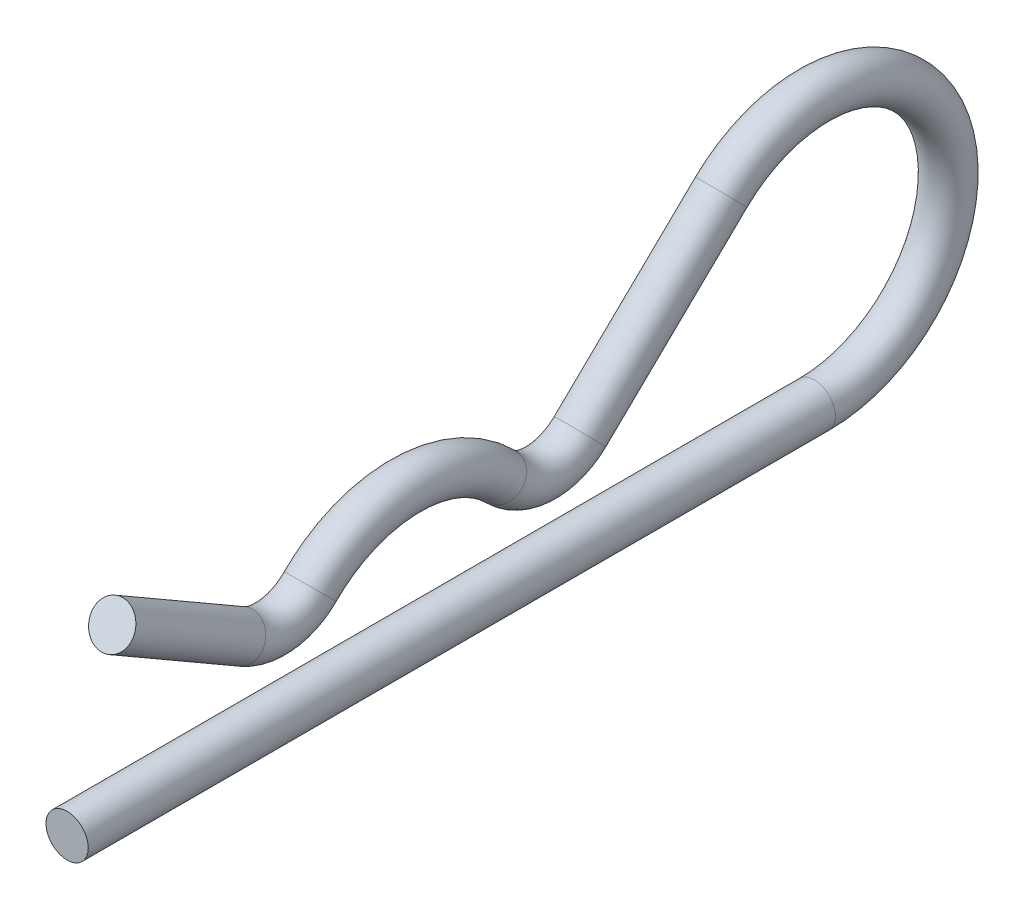
ISO-10303-21;
HEADER;
FILE_DESCRIPTION(('STEP AP214'),'2;1');
FILE_NAME('part.step','',(''),(''),'','','');
FILE_SCHEMA(('AUTOMOTIVE_DESIGN { 1 0 10303 214 1 1 1 1 }'));
ENDSEC;
DATA;
#1=APPLICATION_CONTEXT('core data for automotive mechanical design processes');
#2=APPLICATION_PROTOCOL_DEFINITION('international standard','automotive_design',2000,#1);
#3=PRODUCT_CONTEXT('',#1,'mechanical');
#4=PRODUCT('Part','Part','',(#3));
#5=PRODUCT_RELATED_PRODUCT_CATEGORY('part','',(#4));
#6=PRODUCT_DEFINITION_FORMATION('','',#4);
#7=PRODUCT_DEFINITION_CONTEXT('part definition',#1,'design');
#8=PRODUCT_DEFINITION('design','',#6,#7);
#9=PRODUCT_DEFINITION_SHAPE('','',#8);
#10=(LENGTH_UNIT() NAMED_UNIT(*) SI_UNIT(.MILLI.,.METRE.));
#11=(NAMED_UNIT(*) PLANE_ANGLE_UNIT() SI_UNIT($,.RADIAN.));
#12=(NAMED_UNIT(*) SI_UNIT($,.STERADIAN.) SOLID_ANGLE_UNIT());
#13=UNCERTAINTY_MEASURE_WITH_UNIT(LENGTH_MEASURE(1.E-05),#10,'distance_accuracy_value','');
#14=(GEOMETRIC_REPRESENTATION_CONTEXT(3) GLOBAL_UNCERTAINTY_ASSIGNED_CONTEXT((#13)) GLOBAL_UNIT_ASSIGNED_CONTEXT((#10,
#11,#12)) REPRESENTATION_CONTEXT('',''));
#15=CARTESIAN_POINT('',(0.,0.,0.));
#16=DIRECTION('',(0.,0.,1.));
#17=DIRECTION('',(1.,0.,0.));
#18=AXIS2_PLACEMENT_3D('',#15,#16,#17);
#19=CARTESIAN_POINT('',(0.,2.39549717149222,-4.92455872837049));
#20=DIRECTION('',(0.,0.499999999999991,0.866025403784444));
#21=DIRECTION('',(0.,-0.866025403784444,0.499999999999991));
#22=AXIS2_PLACEMENT_3D('',#19,#20,#21);
#23=CYLINDRICAL_SURFACE('',#22,0.5953125);
#24=CARTESIAN_POINT('',(0.,2.39549717149222,-4.92455872837049));
#25=DIRECTION('',(0.,-0.499999999999979,-0.866025403784451));
#26=DIRECTION('',(1.,0.,0.));
#27=AXIS2_PLACEMENT_3D('',#24,#25,#26);
#28=CIRCLE('',#27,0.5953125);
#29=CARTESIAN_POINT('',(0.,1.87994142330181,-4.62690247837048));
#30=VERTEX_POINT('',#29);
#31=EDGE_CURVE('E39',#30,#30,#28,.T.);
#32=ORIENTED_EDGE('',*,*,#31,.F.);
#33=EDGE_LOOP('',(#32));
#34=FACE_BOUND('',#33,.T.);
#35=CARTESIAN_POINT('',(0.,4.5054576370862,-1.26999999999995));
#36=DIRECTION('',(0.,-0.499999999999979,-0.866025403784451));
#37=DIRECTION('',(1.,0.,0.));
#38=AXIS2_PLACEMENT_3D('',#35,#36,#37);
#39=CIRCLE('',#38,0.5953125);
#40=CARTESIAN_POINT('',(0.5953125,4.5054576370862,-1.26999999999995));
#41=VERTEX_POINT('',#40);
#42=EDGE_CURVE('E10',#41,#41,#39,.T.);
#43=ORIENTED_EDGE('',*,*,#42,.T.);
#44=EDGE_LOOP('',(#43));
#45=FACE_BOUND('',#44,.T.);
#46=ADVANCED_FACE('F33',(#34,#45),#23,.T.);
#47=CARTESIAN_POINT('',(0.,3.7703125,-5.71830872837053));
#48=DIRECTION('',(-1.,0.,0.));
#49=DIRECTION('',(0.,0.,1.));
#50=AXIS2_PLACEMENT_3D('',#47,#48,#49);
#51=TOROIDAL_SURFACE('',#50,1.5875,0.5953125);
#52=CARTESIAN_POINT('',(0.,2.65318287037033,-6.84621725329774));
#53=DIRECTION('',(0.,0.710493559009302,-0.703703703703693));
#54=DIRECTION('',(1.,0.,0.));
#55=AXIS2_PLACEMENT_3D('',#52,#53,#54);
#56=CIRCLE('',#55,0.5953125);
#57=CARTESIAN_POINT('',(0.,2.2342592592592,-7.26918295014544));
#58=VERTEX_POINT('',#57);
#59=EDGE_CURVE('E43',#58,#58,#56,.T.);
#60=CARTESIAN_POINT('',(0.,3.7703125,-5.71830872837053));
#61=DIRECTION('',(-1.,0.,0.));
#62=DIRECTION('',(0.,0.,1.));
#63=AXIS2_PLACEMENT_3D('',#60,#61,#62);
#64=CIRCLE('',#63,2.1828125);
#65=EDGE_CURVE('',#58,#30,#64,.T.);
#66=ORIENTED_EDGE('',*,*,#59,.F.);
#67=ORIENTED_EDGE('',*,*,#31,.T.);
#68=ORIENTED_EDGE('',*,*,#65,.T.);
#69=ORIENTED_EDGE('',*,*,#65,.F.);
#70=EDGE_LOOP('',(#66,#68,#67,#69));
#71=FACE_BOUND('',#70,.T.);
#72=ADVANCED_FACE('F89',(#71),#51,.T.);
#73=CARTESIAN_POINT('',(0.,0.,-9.525));
#74=DIRECTION('',(1.,0.,0.));
#75=DIRECTION('',(0.,0.,-1.));
#76=AXIS2_PLACEMENT_3D('',#73,#74,#75);
#77=TOROIDAL_SURFACE('',#76,3.7703125,0.5953125);
#78=CARTESIAN_POINT('',(0.,2.65318287037041,-12.2037827467022));
#79=DIRECTION('',(0.,-0.710493559009282,-0.703703703703714));
#80=DIRECTION('',(1.,0.,0.));
#81=AXIS2_PLACEMENT_3D('',#78,#79,#80);
#82=CIRCLE('',#81,0.5953125);
#83=CARTESIAN_POINT('',(0.,2.23425925925931,-11.7808170498544));
#84=VERTEX_POINT('',#83);
#85=EDGE_CURVE('E47',#84,#84,#82,.T.);
#86=ORIENTED_EDGE('',*,*,#85,.F.);
#87=EDGE_LOOP('',(#86));
#88=FACE_BOUND('',#87,.T.);
#89=ORIENTED_EDGE('',*,*,#59,.T.);
#90=EDGE_LOOP('',(#89));
#91=FACE_BOUND('',#90,.T.);
#92=ADVANCED_FACE('F83',(#88,#91),#77,.T.);
#93=CARTESIAN_POINT('',(0.,3.7703125,-13.3316912716295));
#94=DIRECTION('',(-1.,0.,0.));
#95=DIRECTION('',(0.,0.,1.));
#96=AXIS2_PLACEMENT_3D('',#93,#94,#95);
#97=TOROIDAL_SURFACE('',#96,1.5875,0.5953125);
#98=CARTESIAN_POINT('',(0.,2.62977122695347,-14.4359203486227));
#99=DIRECTION('',(0.,0.695577371334381,-0.718451195619823));
#100=DIRECTION('',(1.,0.,0.));
#101=AXIS2_PLACEMENT_3D('',#98,#99,#100);
#102=CIRCLE('',#101,0.5953125);
#103=CARTESIAN_POINT('',(0.,2.20206824956103,-14.8500062524952));
#104=VERTEX_POINT('',#103);
#105=EDGE_CURVE('E52',#104,#104,#102,.T.);
#106=CARTESIAN_POINT('',(0.,3.7703125,-13.3316912716295));
#107=DIRECTION('',(-1.,0.,0.));
#108=DIRECTION('',(0.,0.,1.));
#109=AXIS2_PLACEMENT_3D('',#106,#107,#108);
#110=CIRCLE('',#109,2.1828125);
#111=EDGE_CURVE('',#104,#84,#110,.T.);
#112=ORIENTED_EDGE('',*,*,#105,.F.);
#113=ORIENTED_EDGE('',*,*,#85,.T.);
#114=ORIENTED_EDGE('',*,*,#111,.T.);
#115=ORIENTED_EDGE('',*,*,#111,.F.);
#116=EDGE_LOOP('',(#112,#114,#113,#115));
#117=FACE_BOUND('',#116,.T.);
#118=ADVANCED_FACE('F77',(#117),#97,.T.);
#119=CARTESIAN_POINT('',(0.,6.47909802348536,-18.4118309421408));
#120=DIRECTION('',(0.,-0.695577371334371,0.718451195619833));
#121=DIRECTION('',(0.,-0.718451195619833,-0.695577371334371));
#122=AXIS2_PLACEMENT_3D('',#119,#120,#121);
#123=CYLINDRICAL_SURFACE('',#122,0.5953125);
#124=CARTESIAN_POINT('',(0.,6.47909802348536,-18.4118309421408));
#125=DIRECTION('',(0.,0.695577371334381,-0.718451195619823));
#126=DIRECTION('',(1.,0.,0.));
#127=AXIS2_PLACEMENT_3D('',#124,#125,#126);
#128=CIRCLE('',#127,0.5953125);
#129=CARTESIAN_POINT('',(0.,6.90680100087778,-17.9977450382683));
#130=VERTEX_POINT('',#129);
#131=EDGE_CURVE('E55',#130,#130,#128,.T.);
#132=ORIENTED_EDGE('',*,*,#131,.F.);
#133=EDGE_LOOP('',(#132));
#134=FACE_BOUND('',#133,.T.);
#135=ORIENTED_EDGE('',*,*,#105,.T.);
#136=EDGE_LOOP('',(#135));
#137=FACE_BOUND('',#136,.T.);
#138=ADVANCED_FACE('F71',(#134,#137),#123,.T.);
#139=CARTESIAN_POINT('',(0.,3.7703125,-21.034375));
#140=DIRECTION('',(1.,0.,0.));
#141=DIRECTION('',(0.,0.,-1.));
#142=AXIS2_PLACEMENT_3D('',#139,#140,#141);
#143=TOROIDAL_SURFACE('',#142,3.77031249999999,0.5953125);
#144=CARTESIAN_POINT('',(0.,0.,-21.034375));
#145=DIRECTION('',(0.,0.,1.));
#146=DIRECTION('',(1.,0.,0.));
#147=AXIS2_PLACEMENT_3D('',#144,#145,#146);
#148=CIRCLE('',#147,0.5953125);
#149=CARTESIAN_POINT('',(0.,-0.595312499999997,-21.034375));
#150=VERTEX_POINT('',#149);
#151=EDGE_CURVE('E58',#150,#150,#148,.T.);
#152=CARTESIAN_POINT('',(0.,3.7703125,-21.034375));
#153=DIRECTION('',(1.,0.,0.));
#154=DIRECTION('',(0.,0.,-1.));
#155=AXIS2_PLACEMENT_3D('',#152,#153,#154);
#156=CIRCLE('',#155,4.365625);
#157=EDGE_CURVE('',#150,#130,#156,.T.);
#158=ORIENTED_EDGE('',*,*,#151,.F.);
#159=ORIENTED_EDGE('',*,*,#131,.T.);
#160=ORIENTED_EDGE('',*,*,#157,.T.);
#161=ORIENTED_EDGE('',*,*,#157,.F.);
#162=EDGE_LOOP('',(#158,#160,#159,#161));
#163=FACE_BOUND('',#162,.T.);
#164=ADVANCED_FACE('F68',(#163),#143,.T.);
#165=CARTESIAN_POINT('',(0.,0.,-21.034375));
#166=DIRECTION('',(0.,0.,1.));
#167=DIRECTION('',(0.,-1.,0.));
#168=AXIS2_PLACEMENT_3D('',#165,#166,#167);
#169=CYLINDRICAL_SURFACE('',#168,0.5953125);
#170=ORIENTED_EDGE('',*,*,#151,.T.);
#171=EDGE_LOOP('',(#170));
#172=FACE_BOUND('',#171,.T.);
#173=CARTESIAN_POINT('',(0.,0.,0.));
#174=DIRECTION('',(0.,0.,1.));
#175=DIRECTION('',(1.,0.,0.));
#176=AXIS2_PLACEMENT_3D('',#173,#174,#175);
#177=CIRCLE('',#176,0.5953125);
#178=CARTESIAN_POINT('',(0.5953125,0.,0.));
#179=VERTEX_POINT('',#178);
#180=EDGE_CURVE('E59',#179,#179,#177,.T.);
#181=ORIENTED_EDGE('',*,*,#180,.F.);
#182=EDGE_LOOP('',(#181));
#183=FACE_BOUND('',#182,.T.);
#184=ADVANCED_FACE('F65',(#172,#183),#169,.T.);
#185=CARTESIAN_POINT('',(0.,4.5054576370862,-1.26999999999995));
#186=DIRECTION('',(0.,-0.499999999999979,-0.866025403784451));
#187=DIRECTION('',(1.,0.,0.));
#188=AXIS2_PLACEMENT_3D('',#185,#186,#187);
#189=PLANE('',#188);
#190=ORIENTED_EDGE('',*,*,#42,.F.);
#191=EDGE_LOOP('',(#190));
#192=FACE_BOUND('',#191,.T.);
#193=ADVANCED_FACE('F101',(#192),#189,.F.);
#194=CARTESIAN_POINT('',(0.,0.,0.));
#195=DIRECTION('',(0.,0.,1.));
#196=DIRECTION('',(1.,0.,0.));
#197=AXIS2_PLACEMENT_3D('',#194,#195,#196);
#198=PLANE('',#197);
#199=ORIENTED_EDGE('',*,*,#180,.T.);
#200=EDGE_LOOP('',(#199));
#201=FACE_BOUND('',#200,.T.);
#202=ADVANCED_FACE('F102',(#201),#198,.T.);
#203=CLOSED_SHELL('',(#46,#72,#92,#118,#138,#164,#184,#193,#202));
#204=MANIFOLD_SOLID_BREP('B2',#203);
#205=ADVANCED_BREP_SHAPE_REPRESENTATION('',(#18,#204),#14);
#206=SHAPE_DEFINITION_REPRESENTATION(#9,#205);
ENDSEC;
END-ISO-10303-21;
